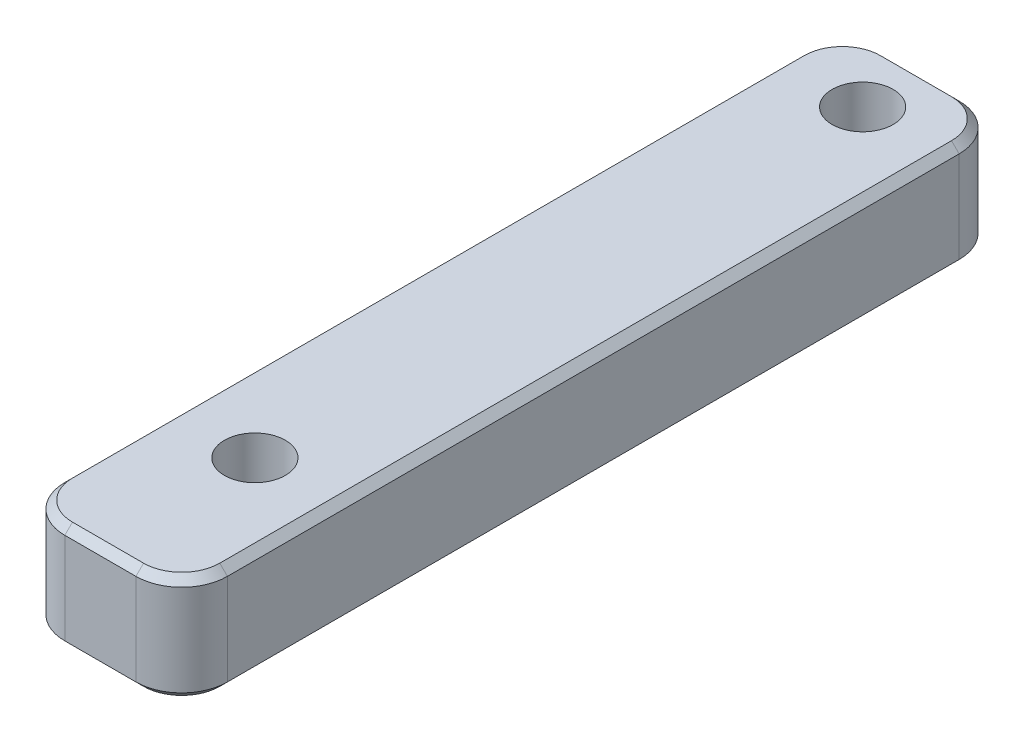
ISO-10303-21;
HEADER;
FILE_DESCRIPTION(('STEP AP214'),'2;1');
FILE_NAME('part.step','',(''),(''),'','','');
FILE_SCHEMA(('AUTOMOTIVE_DESIGN { 1 0 10303 214 1 1 1 1 }'));
ENDSEC;
DATA;
#1=APPLICATION_CONTEXT('core data for automotive mechanical design processes');
#2=APPLICATION_PROTOCOL_DEFINITION('international standard','automotive_design',2000,#1);
#3=PRODUCT_CONTEXT('',#1,'mechanical');
#4=PRODUCT('Part','Part','',(#3));
#5=PRODUCT_RELATED_PRODUCT_CATEGORY('part','',(#4));
#6=PRODUCT_DEFINITION_FORMATION('','',#4);
#7=PRODUCT_DEFINITION_CONTEXT('part definition',#1,'design');
#8=PRODUCT_DEFINITION('design','',#6,#7);
#9=PRODUCT_DEFINITION_SHAPE('','',#8);
#10=(LENGTH_UNIT() NAMED_UNIT(*) SI_UNIT(.MILLI.,.METRE.));
#11=(NAMED_UNIT(*) PLANE_ANGLE_UNIT() SI_UNIT($,.RADIAN.));
#12=(NAMED_UNIT(*) SI_UNIT($,.STERADIAN.) SOLID_ANGLE_UNIT());
#13=UNCERTAINTY_MEASURE_WITH_UNIT(LENGTH_MEASURE(1.E-05),#10,'distance_accuracy_value','');
#14=(GEOMETRIC_REPRESENTATION_CONTEXT(3) GLOBAL_UNCERTAINTY_ASSIGNED_CONTEXT((#13)) GLOBAL_UNIT_ASSIGNED_CONTEXT((#10,
#11,#12)) REPRESENTATION_CONTEXT('',''));
#15=CARTESIAN_POINT('',(0.,0.,0.));
#16=DIRECTION('',(0.,0.,1.));
#17=DIRECTION('',(1.,0.,0.));
#18=AXIS2_PLACEMENT_3D('',#15,#16,#17);
#19=CARTESIAN_POINT('',(0.,3.5,-27.));
#20=DIRECTION('',(0.,0.,1.));
#21=DIRECTION('',(1.,0.,0.));
#22=AXIS2_PLACEMENT_3D('',#19,#20,#21);
#23=PLANE('',#22);
#24=DIRECTION('',(0.,-1.,0.));
#25=VECTOR('',#24,1.);
#26=CARTESIAN_POINT('',(1.5,3.5,-27.));
#27=LINE('',#26,#25);
#28=CARTESIAN_POINT('',(1.5,0.250000000000005,-27.));
#29=VERTEX_POINT('',#28);
#30=CARTESIAN_POINT('',(1.5,3.25,-27.));
#31=VERTEX_POINT('',#30);
#32=EDGE_CURVE('E170',#29,#31,#27,.F.);
#33=ORIENTED_EDGE('',*,*,#32,.T.);
#34=DIRECTION('',(1.,0.,0.));
#35=VECTOR('',#34,1.);
#36=CARTESIAN_POINT('',(3.832575,3.25,-27.));
#37=LINE('',#36,#35);
#38=CARTESIAN_POINT('',(3.832575,3.25,-27.));
#39=VERTEX_POINT('',#38);
#40=EDGE_CURVE('E243',#31,#39,#37,.T.);
#41=ORIENTED_EDGE('',*,*,#40,.T.);
#42=DIRECTION('',(0.,-1.,0.));
#43=VECTOR('',#42,1.);
#44=CARTESIAN_POINT('',(3.832575,3.5,-27.));
#45=LINE('',#44,#43);
#46=CARTESIAN_POINT('',(3.832575,0.250000000000005,-27.));
#47=VERTEX_POINT('',#46);
#48=EDGE_CURVE('E310',#39,#47,#45,.T.);
#49=ORIENTED_EDGE('',*,*,#48,.T.);
#50=DIRECTION('',(-1.,0.,0.));
#51=VECTOR('',#50,1.);
#52=CARTESIAN_POINT('',(0.,0.250000000000005,-27.));
#53=LINE('',#52,#51);
#54=EDGE_CURVE('E241',#47,#29,#53,.T.);
#55=ORIENTED_EDGE('',*,*,#54,.T.);
#56=EDGE_LOOP('',(#33,#41,#49,#55));
#57=FACE_BOUND('',#56,.T.);
#58=ADVANCED_FACE('F35',(#57),#23,.F.);
#59=CARTESIAN_POINT('',(0.,3.5,0.));
#60=DIRECTION('',(1.,0.,0.));
#61=DIRECTION('',(0.,0.,-1.));
#62=AXIS2_PLACEMENT_3D('',#59,#60,#61);
#63=PLANE('',#62);
#64=DIRECTION('',(0.,-1.,0.));
#65=VECTOR('',#64,1.);
#66=CARTESIAN_POINT('',(0.,3.5,-1.5));
#67=LINE('',#66,#65);
#68=CARTESIAN_POINT('',(0.,0.250000000000005,-1.5));
#69=VERTEX_POINT('',#68);
#70=CARTESIAN_POINT('',(0.,3.25,-1.5));
#71=VERTEX_POINT('',#70);
#72=EDGE_CURVE('E338',#69,#71,#67,.F.);
#73=ORIENTED_EDGE('',*,*,#72,.T.);
#74=DIRECTION('',(0.,0.,-1.));
#75=VECTOR('',#74,1.);
#76=CARTESIAN_POINT('',(0.,3.25,-25.5));
#77=LINE('',#76,#75);
#78=CARTESIAN_POINT('',(0.,3.25,-25.5));
#79=VERTEX_POINT('',#78);
#80=EDGE_CURVE('E289',#71,#79,#77,.T.);
#81=ORIENTED_EDGE('',*,*,#80,.T.);
#82=DIRECTION('',(0.,-1.,0.));
#83=VECTOR('',#82,1.);
#84=CARTESIAN_POINT('',(0.,3.5,-25.5));
#85=LINE('',#84,#83);
#86=CARTESIAN_POINT('',(0.,0.250000000000005,-25.5));
#87=VERTEX_POINT('',#86);
#88=EDGE_CURVE('E304',#79,#87,#85,.T.);
#89=ORIENTED_EDGE('',*,*,#88,.T.);
#90=DIRECTION('',(0.,0.,1.));
#91=VECTOR('',#90,1.);
#92=CARTESIAN_POINT('',(0.,0.250000000000005,0.));
#93=LINE('',#92,#91);
#94=EDGE_CURVE('E284',#87,#69,#93,.T.);
#95=ORIENTED_EDGE('',*,*,#94,.T.);
#96=EDGE_LOOP('',(#73,#81,#89,#95));
#97=FACE_BOUND('',#96,.T.);
#98=ADVANCED_FACE('F358',(#97),#63,.F.);
#99=CARTESIAN_POINT('',(0.,3.5,0.));
#100=DIRECTION('',(0.,0.,-1.));
#101=DIRECTION('',(-1.,0.,0.));
#102=AXIS2_PLACEMENT_3D('',#99,#100,#101);
#103=PLANE('',#102);
#104=DIRECTION('',(0.,-1.,0.));
#105=VECTOR('',#104,1.);
#106=CARTESIAN_POINT('',(3.832575,3.5,0.));
#107=LINE('',#106,#105);
#108=CARTESIAN_POINT('',(3.832575,0.250000000000005,0.));
#109=VERTEX_POINT('',#108);
#110=CARTESIAN_POINT('',(3.832575,3.25,0.));
#111=VERTEX_POINT('',#110);
#112=EDGE_CURVE('E344',#109,#111,#107,.F.);
#113=ORIENTED_EDGE('',*,*,#112,.T.);
#114=DIRECTION('',(-1.,0.,0.));
#115=VECTOR('',#114,1.);
#116=CARTESIAN_POINT('',(1.5,3.25,0.));
#117=LINE('',#116,#115);
#118=CARTESIAN_POINT('',(1.5,3.25,0.));
#119=VERTEX_POINT('',#118);
#120=EDGE_CURVE('E331',#111,#119,#117,.T.);
#121=ORIENTED_EDGE('',*,*,#120,.T.);
#122=DIRECTION('',(0.,-1.,0.));
#123=VECTOR('',#122,1.);
#124=CARTESIAN_POINT('',(1.5,3.5,0.));
#125=LINE('',#124,#123);
#126=CARTESIAN_POINT('',(1.5,0.250000000000005,0.));
#127=VERTEX_POINT('',#126);
#128=EDGE_CURVE('E336',#119,#127,#125,.T.);
#129=ORIENTED_EDGE('',*,*,#128,.T.);
#130=DIRECTION('',(1.,0.,0.));
#131=VECTOR('',#130,1.);
#132=CARTESIAN_POINT('',(0.,0.250000000000005,0.));
#133=LINE('',#132,#131);
#134=EDGE_CURVE('E268',#127,#109,#133,.T.);
#135=ORIENTED_EDGE('',*,*,#134,.T.);
#136=EDGE_LOOP('',(#113,#121,#129,#135));
#137=FACE_BOUND('',#136,.T.);
#138=ADVANCED_FACE('F341',(#137),#103,.F.);
#139=CARTESIAN_POINT('',(5.332575,3.5,0.));
#140=DIRECTION('',(-1.,0.,0.));
#141=DIRECTION('',(0.,0.,1.));
#142=AXIS2_PLACEMENT_3D('',#139,#140,#141);
#143=PLANE('',#142);
#144=DIRECTION('',(0.,-1.,0.));
#145=VECTOR('',#144,1.);
#146=CARTESIAN_POINT('',(5.332575,3.5,-25.5));
#147=LINE('',#146,#145);
#148=CARTESIAN_POINT('',(5.332575,0.250000000000005,-25.5));
#149=VERTEX_POINT('',#148);
#150=CARTESIAN_POINT('',(5.332575,3.25,-25.5));
#151=VERTEX_POINT('',#150);
#152=EDGE_CURVE('E348',#149,#151,#147,.F.);
#153=ORIENTED_EDGE('',*,*,#152,.T.);
#154=DIRECTION('',(0.,0.,1.));
#155=VECTOR('',#154,1.);
#156=CARTESIAN_POINT('',(5.332575,3.25,-1.5));
#157=LINE('',#156,#155);
#158=CARTESIAN_POINT('',(5.332575,3.25,-1.5));
#159=VERTEX_POINT('',#158);
#160=EDGE_CURVE('E227',#151,#159,#157,.T.);
#161=ORIENTED_EDGE('',*,*,#160,.T.);
#162=DIRECTION('',(0.,-1.,0.));
#163=VECTOR('',#162,1.);
#164=CARTESIAN_POINT('',(5.332575,3.5,-1.5));
#165=LINE('',#164,#163);
#166=CARTESIAN_POINT('',(5.332575,0.250000000000005,-1.5));
#167=VERTEX_POINT('',#166);
#168=EDGE_CURVE('E345',#159,#167,#165,.T.);
#169=ORIENTED_EDGE('',*,*,#168,.T.);
#170=DIRECTION('',(0.,0.,-1.));
#171=VECTOR('',#170,1.);
#172=CARTESIAN_POINT('',(5.332575,0.250000000000005,0.));
#173=LINE('',#172,#171);
#174=EDGE_CURVE('E233',#167,#149,#173,.T.);
#175=ORIENTED_EDGE('',*,*,#174,.T.);
#176=EDGE_LOOP('',(#153,#161,#169,#175));
#177=FACE_BOUND('',#176,.T.);
#178=ADVANCED_FACE('F414',(#177),#143,.F.);
#179=CARTESIAN_POINT('',(0.,3.5,0.));
#180=DIRECTION('',(0.,1.,0.));
#181=DIRECTION('',(0.,0.,1.));
#182=AXIS2_PLACEMENT_3D('',#179,#180,#181);
#183=PLANE('',#182);
#184=DIRECTION('',(1.,0.,0.));
#185=VECTOR('',#184,1.);
#186=CARTESIAN_POINT('',(3.832575,3.5,-0.25));
#187=LINE('',#186,#185);
#188=CARTESIAN_POINT('',(1.5,3.5,-0.25));
#189=VERTEX_POINT('',#188);
#190=CARTESIAN_POINT('',(3.832575,3.5,-0.25));
#191=VERTEX_POINT('',#190);
#192=EDGE_CURVE('E322',#189,#191,#187,.T.);
#193=ORIENTED_EDGE('',*,*,#192,.T.);
#194=CARTESIAN_POINT('',(3.832575,3.5,-1.5));
#195=DIRECTION('',(0.,1.,0.));
#196=DIRECTION('',(0.,0.,1.));
#197=AXIS2_PLACEMENT_3D('',#194,#195,#196);
#198=CIRCLE('',#197,1.25);
#199=CARTESIAN_POINT('',(5.082575,3.5,-1.5));
#200=VERTEX_POINT('',#199);
#201=EDGE_CURVE('E324',#191,#200,#198,.T.);
#202=ORIENTED_EDGE('',*,*,#201,.T.);
#203=DIRECTION('',(0.,0.,-1.));
#204=VECTOR('',#203,1.);
#205=CARTESIAN_POINT('',(5.082575,3.5,-25.5));
#206=LINE('',#205,#204);
#207=CARTESIAN_POINT('',(5.082575,3.5,-25.5));
#208=VERTEX_POINT('',#207);
#209=EDGE_CURVE('E155',#200,#208,#206,.T.);
#210=ORIENTED_EDGE('',*,*,#209,.T.);
#211=CARTESIAN_POINT('',(3.832575,3.5,-25.5));
#212=DIRECTION('',(0.,1.,0.));
#213=DIRECTION('',(0.,0.,1.));
#214=AXIS2_PLACEMENT_3D('',#211,#212,#213);
#215=CIRCLE('',#214,1.25);
#216=CARTESIAN_POINT('',(3.832575,3.5,-26.75));
#217=VERTEX_POINT('',#216);
#218=EDGE_CURVE('E147',#208,#217,#215,.T.);
#219=ORIENTED_EDGE('',*,*,#218,.T.);
#220=DIRECTION('',(-1.,0.,0.));
#221=VECTOR('',#220,1.);
#222=CARTESIAN_POINT('',(1.5,3.5,-26.75));
#223=LINE('',#222,#221);
#224=CARTESIAN_POINT('',(1.5,3.5,-26.75));
#225=VERTEX_POINT('',#224);
#226=EDGE_CURVE('E151',#217,#225,#223,.T.);
#227=ORIENTED_EDGE('',*,*,#226,.T.);
#228=CARTESIAN_POINT('',(1.5,3.5,-25.5));
#229=DIRECTION('',(0.,1.,0.));
#230=DIRECTION('',(0.,0.,1.));
#231=AXIS2_PLACEMENT_3D('',#228,#229,#230);
#232=CIRCLE('',#231,1.25);
#233=CARTESIAN_POINT('',(0.249999999999999,3.5,-25.5));
#234=VERTEX_POINT('',#233);
#235=EDGE_CURVE('E313',#225,#234,#232,.T.);
#236=ORIENTED_EDGE('',*,*,#235,.T.);
#237=DIRECTION('',(0.,0.,1.));
#238=VECTOR('',#237,1.);
#239=CARTESIAN_POINT('',(0.25,3.5,-1.5));
#240=LINE('',#239,#238);
#241=CARTESIAN_POINT('',(0.25,3.5,-1.5));
#242=VERTEX_POINT('',#241);
#243=EDGE_CURVE('E315',#234,#242,#240,.T.);
#244=ORIENTED_EDGE('',*,*,#243,.T.);
#245=CARTESIAN_POINT('',(1.5,3.5,-1.5));
#246=DIRECTION('',(0.,1.,0.));
#247=DIRECTION('',(0.,0.,1.));
#248=AXIS2_PLACEMENT_3D('',#245,#246,#247);
#249=CIRCLE('',#248,1.25);
#250=EDGE_CURVE('E317',#242,#189,#249,.T.);
#251=ORIENTED_EDGE('',*,*,#250,.T.);
#252=EDGE_LOOP('',(#193,#202,#210,#219,#227,#236,#244,#251));
#253=FACE_BOUND('',#252,.T.);
#254=CARTESIAN_POINT('',(2.6662875,3.5,-5.06736000000001));
#255=DIRECTION('',(0.,1.,0.));
#256=DIRECTION('',(0.,0.,1.));
#257=AXIS2_PLACEMENT_3D('',#254,#255,#256);
#258=CIRCLE('',#257,1.);
#259=CARTESIAN_POINT('',(2.6662875,3.5,-4.06736000000001));
#260=VERTEX_POINT('',#259);
#261=EDGE_CURVE('E188',#260,#260,#258,.T.);
#262=ORIENTED_EDGE('',*,*,#261,.F.);
#263=EDGE_LOOP('',(#262));
#264=FACE_BOUND('',#263,.T.);
#265=CARTESIAN_POINT('',(2.6662875,3.5,-25.));
#266=DIRECTION('',(0.,1.,0.));
#267=DIRECTION('',(0.,0.,1.));
#268=AXIS2_PLACEMENT_3D('',#265,#266,#267);
#269=CIRCLE('',#268,1.);
#270=CARTESIAN_POINT('',(2.6662875,3.5,-24.));
#271=VERTEX_POINT('',#270);
#272=EDGE_CURVE('E607',#271,#271,#269,.T.);
#273=ORIENTED_EDGE('',*,*,#272,.F.);
#274=EDGE_LOOP('',(#273));
#275=FACE_BOUND('',#274,.T.);
#276=ADVANCED_FACE('F149',(#253,#264,#275),#183,.T.);
#277=CARTESIAN_POINT('',(0.,0.,0.));
#278=DIRECTION('',(0.,1.,0.));
#279=DIRECTION('',(0.,0.,1.));
#280=AXIS2_PLACEMENT_3D('',#277,#278,#279);
#281=PLANE('',#280);
#282=DIRECTION('',(-1.,0.,0.));
#283=VECTOR('',#282,1.);
#284=CARTESIAN_POINT('',(0.,0.,-0.25));
#285=LINE('',#284,#283);
#286=CARTESIAN_POINT('',(3.832575,0.,-0.25));
#287=VERTEX_POINT('',#286);
#288=CARTESIAN_POINT('',(1.5,0.,-0.25));
#289=VERTEX_POINT('',#288);
#290=EDGE_CURVE('E44',#287,#289,#285,.T.);
#291=ORIENTED_EDGE('',*,*,#290,.T.);
#292=CARTESIAN_POINT('',(1.5,0.,-1.5));
#293=DIRECTION('',(0.,1.,0.));
#294=DIRECTION('',(0.,0.,1.));
#295=AXIS2_PLACEMENT_3D('',#292,#293,#294);
#296=CIRCLE('',#295,1.25);
#297=CARTESIAN_POINT('',(0.25,0.,-1.5));
#298=VERTEX_POINT('',#297);
#299=EDGE_CURVE('E11',#289,#298,#296,.F.);
#300=ORIENTED_EDGE('',*,*,#299,.T.);
#301=DIRECTION('',(0.,0.,-1.));
#302=VECTOR('',#301,1.);
#303=CARTESIAN_POINT('',(0.25,0.,0.));
#304=LINE('',#303,#302);
#305=CARTESIAN_POINT('',(0.249999999999999,0.,-25.5));
#306=VERTEX_POINT('',#305);
#307=EDGE_CURVE('E251',#298,#306,#304,.T.);
#308=ORIENTED_EDGE('',*,*,#307,.T.);
#309=CARTESIAN_POINT('',(1.5,0.,-25.5));
#310=DIRECTION('',(0.,1.,0.));
#311=DIRECTION('',(0.,0.,1.));
#312=AXIS2_PLACEMENT_3D('',#309,#310,#311);
#313=CIRCLE('',#312,1.25);
#314=CARTESIAN_POINT('',(1.5,0.,-26.75));
#315=VERTEX_POINT('',#314);
#316=EDGE_CURVE('E249',#306,#315,#313,.F.);
#317=ORIENTED_EDGE('',*,*,#316,.T.);
#318=DIRECTION('',(1.,0.,0.));
#319=VECTOR('',#318,1.);
#320=CARTESIAN_POINT('',(0.,0.,-26.75));
#321=LINE('',#320,#319);
#322=CARTESIAN_POINT('',(3.832575,0.,-26.75));
#323=VERTEX_POINT('',#322);
#324=EDGE_CURVE('E247',#315,#323,#321,.T.);
#325=ORIENTED_EDGE('',*,*,#324,.T.);
#326=CARTESIAN_POINT('',(3.832575,0.,-25.5));
#327=DIRECTION('',(0.,1.,0.));
#328=DIRECTION('',(0.,0.,1.));
#329=AXIS2_PLACEMENT_3D('',#326,#327,#328);
#330=CIRCLE('',#329,1.25);
#331=CARTESIAN_POINT('',(5.082575,0.,-25.5));
#332=VERTEX_POINT('',#331);
#333=EDGE_CURVE('E245',#323,#332,#330,.F.);
#334=ORIENTED_EDGE('',*,*,#333,.T.);
#335=DIRECTION('',(0.,0.,1.));
#336=VECTOR('',#335,1.);
#337=CARTESIAN_POINT('',(5.082575,0.,0.));
#338=LINE('',#337,#336);
#339=CARTESIAN_POINT('',(5.082575,0.,-1.5));
#340=VERTEX_POINT('',#339);
#341=EDGE_CURVE('E253',#332,#340,#338,.T.);
#342=ORIENTED_EDGE('',*,*,#341,.T.);
#343=CARTESIAN_POINT('',(3.832575,0.,-1.5));
#344=DIRECTION('',(0.,1.,0.));
#345=DIRECTION('',(0.,0.,1.));
#346=AXIS2_PLACEMENT_3D('',#343,#344,#345);
#347=CIRCLE('',#346,1.25);
#348=EDGE_CURVE('E55',#340,#287,#347,.F.);
#349=ORIENTED_EDGE('',*,*,#348,.T.);
#350=EDGE_LOOP('',(#291,#300,#308,#317,#325,#334,#342,#349));
#351=FACE_BOUND('',#350,.T.);
#352=CARTESIAN_POINT('',(2.6662875,0.,-5.06736000000001));
#353=DIRECTION('',(0.,1.,0.));
#354=DIRECTION('',(0.,0.,1.));
#355=AXIS2_PLACEMENT_3D('',#352,#353,#354);
#356=CIRCLE('',#355,1.);
#357=CARTESIAN_POINT('',(2.6662875,0.,-4.06736000000001));
#358=VERTEX_POINT('',#357);
#359=EDGE_CURVE('E611',#358,#358,#356,.T.);
#360=ORIENTED_EDGE('',*,*,#359,.T.);
#361=EDGE_LOOP('',(#360));
#362=FACE_BOUND('',#361,.T.);
#363=CARTESIAN_POINT('',(2.6662875,0.,-25.));
#364=DIRECTION('',(0.,1.,0.));
#365=DIRECTION('',(0.,0.,1.));
#366=AXIS2_PLACEMENT_3D('',#363,#364,#365);
#367=CIRCLE('',#366,1.);
#368=CARTESIAN_POINT('',(2.6662875,0.,-24.));
#369=VERTEX_POINT('',#368);
#370=EDGE_CURVE('E605',#369,#369,#367,.T.);
#371=ORIENTED_EDGE('',*,*,#370,.T.);
#372=EDGE_LOOP('',(#371));
#373=FACE_BOUND('',#372,.T.);
#374=ADVANCED_FACE('F256',(#351,#362,#373),#281,.F.);
#375=CARTESIAN_POINT('',(3.832575,3.5,-1.5));
#376=DIRECTION('',(0.,-1.,0.));
#377=DIRECTION('',(0.,0.,-1.));
#378=AXIS2_PLACEMENT_3D('',#375,#376,#377);
#379=CYLINDRICAL_SURFACE('',#378,1.5);
#380=ORIENTED_EDGE('',*,*,#168,.F.);
#381=CARTESIAN_POINT('',(3.832575,3.25,-1.5));
#382=DIRECTION('',(0.,1.,0.));
#383=DIRECTION('',(0.,0.,1.));
#384=AXIS2_PLACEMENT_3D('',#381,#382,#383);
#385=CIRCLE('',#384,1.5);
#386=EDGE_CURVE('E327',#159,#111,#385,.F.);
#387=ORIENTED_EDGE('',*,*,#386,.T.);
#388=ORIENTED_EDGE('',*,*,#112,.F.);
#389=CARTESIAN_POINT('',(3.832575,0.250000000000005,-1.5));
#390=DIRECTION('',(0.,1.,0.));
#391=DIRECTION('',(0.,0.,1.));
#392=AXIS2_PLACEMENT_3D('',#389,#390,#391);
#393=CIRCLE('',#392,1.5);
#394=EDGE_CURVE('E263',#109,#167,#393,.T.);
#395=ORIENTED_EDGE('',*,*,#394,.T.);
#396=EDGE_LOOP('',(#380,#387,#388,#395));
#397=FACE_BOUND('',#396,.T.);
#398=ADVANCED_FACE('F388',(#397),#379,.T.);
#399=CARTESIAN_POINT('',(1.5,3.5,-1.5));
#400=DIRECTION('',(0.,-1.,0.));
#401=DIRECTION('',(0.,0.,-1.));
#402=AXIS2_PLACEMENT_3D('',#399,#400,#401);
#403=CYLINDRICAL_SURFACE('',#402,1.5);
#404=ORIENTED_EDGE('',*,*,#128,.F.);
#405=CARTESIAN_POINT('',(1.5,3.25,-1.5));
#406=DIRECTION('',(0.,1.,0.));
#407=DIRECTION('',(0.,0.,1.));
#408=AXIS2_PLACEMENT_3D('',#405,#406,#407);
#409=CIRCLE('',#408,1.5);
#410=EDGE_CURVE('E290',#119,#71,#409,.F.);
#411=ORIENTED_EDGE('',*,*,#410,.T.);
#412=ORIENTED_EDGE('',*,*,#72,.F.);
#413=CARTESIAN_POINT('',(1.5,0.250000000000005,-1.5));
#414=DIRECTION('',(0.,1.,0.));
#415=DIRECTION('',(0.,0.,1.));
#416=AXIS2_PLACEMENT_3D('',#413,#414,#415);
#417=CIRCLE('',#416,1.5);
#418=EDGE_CURVE('E294',#69,#127,#417,.T.);
#419=ORIENTED_EDGE('',*,*,#418,.T.);
#420=EDGE_LOOP('',(#404,#411,#412,#419));
#421=FACE_BOUND('',#420,.T.);
#422=ADVANCED_FACE('F335',(#421),#403,.T.);
#423=CARTESIAN_POINT('',(1.5,3.5,-25.5));
#424=DIRECTION('',(0.,-1.,0.));
#425=DIRECTION('',(0.,0.,-1.));
#426=AXIS2_PLACEMENT_3D('',#423,#424,#425);
#427=CYLINDRICAL_SURFACE('',#426,1.5);
#428=ORIENTED_EDGE('',*,*,#88,.F.);
#429=CARTESIAN_POINT('',(1.5,3.25,-25.5));
#430=DIRECTION('',(0.,1.,0.));
#431=DIRECTION('',(0.,0.,1.));
#432=AXIS2_PLACEMENT_3D('',#429,#430,#431);
#433=CIRCLE('',#432,1.5);
#434=EDGE_CURVE('E236',#79,#31,#433,.F.);
#435=ORIENTED_EDGE('',*,*,#434,.T.);
#436=ORIENTED_EDGE('',*,*,#32,.F.);
#437=CARTESIAN_POINT('',(1.5,0.250000000000005,-25.5));
#438=DIRECTION('',(0.,1.,0.));
#439=DIRECTION('',(0.,0.,1.));
#440=AXIS2_PLACEMENT_3D('',#437,#438,#439);
#441=CIRCLE('',#440,1.5);
#442=EDGE_CURVE('E292',#29,#87,#441,.T.);
#443=ORIENTED_EDGE('',*,*,#442,.T.);
#444=EDGE_LOOP('',(#428,#435,#436,#443));
#445=FACE_BOUND('',#444,.T.);
#446=ADVANCED_FACE('F303',(#445),#427,.T.);
#447=CARTESIAN_POINT('',(3.832575,3.5,-25.5));
#448=DIRECTION('',(0.,-1.,0.));
#449=DIRECTION('',(0.,0.,-1.));
#450=AXIS2_PLACEMENT_3D('',#447,#448,#449);
#451=CYLINDRICAL_SURFACE('',#450,1.5);
#452=ORIENTED_EDGE('',*,*,#48,.F.);
#453=CARTESIAN_POINT('',(3.832575,3.25,-25.5));
#454=DIRECTION('',(0.,1.,0.));
#455=DIRECTION('',(0.,0.,1.));
#456=AXIS2_PLACEMENT_3D('',#453,#454,#455);
#457=CIRCLE('',#456,1.5);
#458=EDGE_CURVE('E173',#39,#151,#457,.F.);
#459=ORIENTED_EDGE('',*,*,#458,.T.);
#460=ORIENTED_EDGE('',*,*,#152,.F.);
#461=CARTESIAN_POINT('',(3.832575,0.250000000000005,-25.5));
#462=DIRECTION('',(0.,1.,0.));
#463=DIRECTION('',(0.,0.,1.));
#464=AXIS2_PLACEMENT_3D('',#461,#462,#463);
#465=CIRCLE('',#464,1.5);
#466=EDGE_CURVE('E232',#149,#47,#465,.T.);
#467=ORIENTED_EDGE('',*,*,#466,.T.);
#468=EDGE_LOOP('',(#452,#459,#460,#467));
#469=FACE_BOUND('',#468,.T.);
#470=ADVANCED_FACE('F395',(#469),#451,.T.);
#471=CARTESIAN_POINT('',(2.6662875,0.,-25.));
#472=DIRECTION('',(0.,1.,0.));
#473=DIRECTION('',(0.,0.,1.));
#474=AXIS2_PLACEMENT_3D('',#471,#472,#473);
#475=CYLINDRICAL_SURFACE('',#474,1.);
#476=ORIENTED_EDGE('',*,*,#370,.F.);
#477=EDGE_LOOP('',(#476));
#478=FACE_BOUND('',#477,.T.);
#479=ORIENTED_EDGE('',*,*,#272,.T.);
#480=EDGE_LOOP('',(#479));
#481=FACE_BOUND('',#480,.T.);
#482=ADVANCED_FACE('F397',(#478,#481),#475,.F.);
#483=CARTESIAN_POINT('',(2.6662875,0.,-5.06736000000001));
#484=DIRECTION('',(0.,1.,0.));
#485=DIRECTION('',(0.,0.,1.));
#486=AXIS2_PLACEMENT_3D('',#483,#484,#485);
#487=CYLINDRICAL_SURFACE('',#486,1.);
#488=ORIENTED_EDGE('',*,*,#359,.F.);
#489=EDGE_LOOP('',(#488));
#490=FACE_BOUND('',#489,.T.);
#491=ORIENTED_EDGE('',*,*,#261,.T.);
#492=EDGE_LOOP('',(#491));
#493=FACE_BOUND('',#492,.T.);
#494=ADVANCED_FACE('F401',(#490,#493),#487,.F.);
#495=CARTESIAN_POINT('',(1.5,3.5,-25.5));
#496=DIRECTION('',(0.,-1.,0.));
#497=DIRECTION('',(0.,0.,-1.));
#498=AXIS2_PLACEMENT_3D('',#495,#496,#497);
#499=CONICAL_SURFACE('',#498,1.25,0.785398163397446);
#500=DIRECTION('',(0.,0.707106781186547,0.707106781186547));
#501=VECTOR('',#500,1.);
#502=CARTESIAN_POINT('',(1.5,3.25,-27.));
#503=LINE('',#502,#501);
#504=EDGE_CURVE('E169',#31,#225,#503,.T.);
#505=ORIENTED_EDGE('',*,*,#504,.F.);
#506=ORIENTED_EDGE('',*,*,#434,.F.);
#507=DIRECTION('',(-0.707106781186546,-0.707106781186549,0.));
#508=VECTOR('',#507,1.);
#509=CARTESIAN_POINT('',(0.249999999999999,3.5,-25.5));
#510=LINE('',#509,#508);
#511=EDGE_CURVE('E185',#234,#79,#510,.T.);
#512=ORIENTED_EDGE('',*,*,#511,.F.);
#513=ORIENTED_EDGE('',*,*,#235,.F.);
#514=EDGE_LOOP('',(#505,#506,#512,#513));
#515=FACE_BOUND('',#514,.T.);
#516=ADVANCED_FACE('F312',(#515),#499,.T.);
#517=CARTESIAN_POINT('',(0.25,3.5,0.));
#518=DIRECTION('',(-0.707106781186547,0.707106781186547,0.));
#519=DIRECTION('',(0.,0.,-1.));
#520=AXIS2_PLACEMENT_3D('',#517,#518,#519);
#521=PLANE('',#520);
#522=ORIENTED_EDGE('',*,*,#511,.T.);
#523=ORIENTED_EDGE('',*,*,#80,.F.);
#524=DIRECTION('',(-0.707106781186547,-0.707106781186547,0.));
#525=VECTOR('',#524,1.);
#526=CARTESIAN_POINT('',(0.25,3.5,-1.5));
#527=LINE('',#526,#525);
#528=EDGE_CURVE('E174',#242,#71,#527,.T.);
#529=ORIENTED_EDGE('',*,*,#528,.F.);
#530=ORIENTED_EDGE('',*,*,#243,.F.);
#531=EDGE_LOOP('',(#522,#523,#529,#530));
#532=FACE_BOUND('',#531,.T.);
#533=ADVANCED_FACE('F362',(#532),#521,.T.);
#534=CARTESIAN_POINT('',(0.,3.5,-26.75));
#535=DIRECTION('',(0.,0.707106781186547,-0.707106781186547));
#536=DIRECTION('',(1.,0.,0.));
#537=AXIS2_PLACEMENT_3D('',#534,#535,#536);
#538=PLANE('',#537);
#539=ORIENTED_EDGE('',*,*,#504,.T.);
#540=ORIENTED_EDGE('',*,*,#226,.F.);
#541=DIRECTION('',(0.,0.707106781186547,0.707106781186547));
#542=VECTOR('',#541,1.);
#543=CARTESIAN_POINT('',(3.832575,3.25,-27.));
#544=LINE('',#543,#542);
#545=EDGE_CURVE('E166',#39,#217,#544,.T.);
#546=ORIENTED_EDGE('',*,*,#545,.F.);
#547=ORIENTED_EDGE('',*,*,#40,.F.);
#548=EDGE_LOOP('',(#539,#540,#546,#547));
#549=FACE_BOUND('',#548,.T.);
#550=ADVANCED_FACE('F164',(#549),#538,.T.);
#551=CARTESIAN_POINT('',(1.5,3.5,-1.5));
#552=DIRECTION('',(0.,-1.,0.));
#553=DIRECTION('',(0.,0.,-1.));
#554=AXIS2_PLACEMENT_3D('',#551,#552,#553);
#555=CONICAL_SURFACE('',#554,1.25,0.785398163397448);
#556=ORIENTED_EDGE('',*,*,#528,.T.);
#557=ORIENTED_EDGE('',*,*,#410,.F.);
#558=DIRECTION('',(0.,-0.707106781186547,0.707106781186547));
#559=VECTOR('',#558,1.);
#560=CARTESIAN_POINT('',(1.5,3.5,-0.25));
#561=LINE('',#560,#559);
#562=EDGE_CURVE('E175',#189,#119,#561,.T.);
#563=ORIENTED_EDGE('',*,*,#562,.F.);
#564=ORIENTED_EDGE('',*,*,#250,.F.);
#565=EDGE_LOOP('',(#556,#557,#563,#564));
#566=FACE_BOUND('',#565,.T.);
#567=ADVANCED_FACE('F365',(#566),#555,.T.);
#568=CARTESIAN_POINT('',(3.832575,3.5,-25.5));
#569=DIRECTION('',(0.,-1.,0.));
#570=DIRECTION('',(0.,0.,-1.));
#571=AXIS2_PLACEMENT_3D('',#568,#569,#570);
#572=CONICAL_SURFACE('',#571,1.25,0.785398163397448);
#573=ORIENTED_EDGE('',*,*,#545,.T.);
#574=ORIENTED_EDGE('',*,*,#218,.F.);
#575=DIRECTION('',(-0.707106781186546,0.707106781186549,0.));
#576=VECTOR('',#575,1.);
#577=CARTESIAN_POINT('',(5.332575,3.25,-25.5));
#578=LINE('',#577,#576);
#579=EDGE_CURVE('E180',#151,#208,#578,.T.);
#580=ORIENTED_EDGE('',*,*,#579,.F.);
#581=ORIENTED_EDGE('',*,*,#458,.F.);
#582=EDGE_LOOP('',(#573,#574,#580,#581));
#583=FACE_BOUND('',#582,.T.);
#584=ADVANCED_FACE('F172',(#583),#572,.T.);
#585=CARTESIAN_POINT('',(0.,3.5,-0.25));
#586=DIRECTION('',(0.,0.707106781186547,0.707106781186547));
#587=DIRECTION('',(-1.,0.,0.));
#588=AXIS2_PLACEMENT_3D('',#585,#586,#587);
#589=PLANE('',#588);
#590=ORIENTED_EDGE('',*,*,#562,.T.);
#591=ORIENTED_EDGE('',*,*,#120,.F.);
#592=DIRECTION('',(0.,-0.707106781186547,0.707106781186547));
#593=VECTOR('',#592,1.);
#594=CARTESIAN_POINT('',(3.832575,3.5,-0.25));
#595=LINE('',#594,#593);
#596=EDGE_CURVE('E216',#191,#111,#595,.T.);
#597=ORIENTED_EDGE('',*,*,#596,.F.);
#598=ORIENTED_EDGE('',*,*,#192,.F.);
#599=EDGE_LOOP('',(#590,#591,#597,#598));
#600=FACE_BOUND('',#599,.T.);
#601=ADVANCED_FACE('F370',(#600),#589,.T.);
#602=CARTESIAN_POINT('',(5.082575,3.5,0.));
#603=DIRECTION('',(0.707106781186547,0.707106781186547,0.));
#604=DIRECTION('',(0.,0.,1.));
#605=AXIS2_PLACEMENT_3D('',#602,#603,#604);
#606=PLANE('',#605);
#607=ORIENTED_EDGE('',*,*,#579,.T.);
#608=ORIENTED_EDGE('',*,*,#209,.F.);
#609=DIRECTION('',(-0.707106781186547,0.707106781186547,0.));
#610=VECTOR('',#609,1.);
#611=CARTESIAN_POINT('',(5.332575,3.25,-1.5));
#612=LINE('',#611,#610);
#613=EDGE_CURVE('E211',#159,#200,#612,.T.);
#614=ORIENTED_EDGE('',*,*,#613,.F.);
#615=ORIENTED_EDGE('',*,*,#160,.F.);
#616=EDGE_LOOP('',(#607,#608,#614,#615));
#617=FACE_BOUND('',#616,.T.);
#618=ADVANCED_FACE('F226',(#617),#606,.T.);
#619=CARTESIAN_POINT('',(3.832575,3.5,-1.5));
#620=DIRECTION('',(0.,-1.,0.));
#621=DIRECTION('',(0.,0.,-1.));
#622=AXIS2_PLACEMENT_3D('',#619,#620,#621);
#623=CONICAL_SURFACE('',#622,1.25,0.785398163397448);
#624=ORIENTED_EDGE('',*,*,#596,.T.);
#625=ORIENTED_EDGE('',*,*,#386,.F.);
#626=ORIENTED_EDGE('',*,*,#613,.T.);
#627=ORIENTED_EDGE('',*,*,#201,.F.);
#628=EDGE_LOOP('',(#624,#625,#626,#627));
#629=FACE_BOUND('',#628,.T.);
#630=ADVANCED_FACE('F371',(#629),#623,.T.);
#631=CARTESIAN_POINT('',(3.832575,0.,-25.5));
#632=DIRECTION('',(0.,1.,0.));
#633=DIRECTION('',(0.,0.,1.));
#634=AXIS2_PLACEMENT_3D('',#631,#632,#633);
#635=CONICAL_SURFACE('',#634,1.25,0.785398163397439);
#636=DIRECTION('',(0.,-0.707106781186554,0.707106781186541));
#637=VECTOR('',#636,1.);
#638=CARTESIAN_POINT('',(3.832575,0.250000000000005,-27.));
#639=LINE('',#638,#637);
#640=EDGE_CURVE('E204',#47,#323,#639,.T.);
#641=ORIENTED_EDGE('',*,*,#640,.F.);
#642=ORIENTED_EDGE('',*,*,#466,.F.);
#643=DIRECTION('',(0.707106781186541,0.707106781186554,0.));
#644=VECTOR('',#643,1.);
#645=CARTESIAN_POINT('',(5.082575,0.,-25.5));
#646=LINE('',#645,#644);
#647=EDGE_CURVE('E39',#332,#149,#646,.T.);
#648=ORIENTED_EDGE('',*,*,#647,.F.);
#649=ORIENTED_EDGE('',*,*,#333,.F.);
#650=EDGE_LOOP('',(#641,#642,#648,#649));
#651=FACE_BOUND('',#650,.T.);
#652=ADVANCED_FACE('F37',(#651),#635,.T.);
#653=CARTESIAN_POINT('',(5.332575,0.250000000000005,0.));
#654=DIRECTION('',(-0.707106781186554,0.707106781186541,0.));
#655=DIRECTION('',(0.,0.,-1.));
#656=AXIS2_PLACEMENT_3D('',#653,#654,#655);
#657=PLANE('',#656);
#658=ORIENTED_EDGE('',*,*,#647,.T.);
#659=ORIENTED_EDGE('',*,*,#174,.F.);
#660=DIRECTION('',(0.707106781186541,0.707106781186554,0.));
#661=VECTOR('',#660,1.);
#662=CARTESIAN_POINT('',(5.082575,0.,-1.5));
#663=LINE('',#662,#661);
#664=EDGE_CURVE('E202',#340,#167,#663,.T.);
#665=ORIENTED_EDGE('',*,*,#664,.F.);
#666=ORIENTED_EDGE('',*,*,#341,.F.);
#667=EDGE_LOOP('',(#658,#659,#665,#666));
#668=FACE_BOUND('',#667,.T.);
#669=ADVANCED_FACE('F259',(#668),#657,.F.);
#670=CARTESIAN_POINT('',(0.,0.250000000000005,-27.));
#671=DIRECTION('',(0.,0.707106781186541,0.707106781186554));
#672=DIRECTION('',(-1.,0.,0.));
#673=AXIS2_PLACEMENT_3D('',#670,#671,#672);
#674=PLANE('',#673);
#675=ORIENTED_EDGE('',*,*,#640,.T.);
#676=ORIENTED_EDGE('',*,*,#324,.F.);
#677=DIRECTION('',(0.,-0.707106781186554,0.707106781186541));
#678=VECTOR('',#677,1.);
#679=CARTESIAN_POINT('',(1.5,0.250000000000005,-27.));
#680=LINE('',#679,#678);
#681=EDGE_CURVE('E199',#29,#315,#680,.T.);
#682=ORIENTED_EDGE('',*,*,#681,.F.);
#683=ORIENTED_EDGE('',*,*,#54,.F.);
#684=EDGE_LOOP('',(#675,#676,#682,#683));
#685=FACE_BOUND('',#684,.T.);
#686=ADVANCED_FACE('F357',(#685),#674,.F.);
#687=CARTESIAN_POINT('',(3.832575,0.,-1.5));
#688=DIRECTION('',(0.,1.,0.));
#689=DIRECTION('',(0.,0.,1.));
#690=AXIS2_PLACEMENT_3D('',#687,#688,#689);
#691=CONICAL_SURFACE('',#690,1.25,0.785398163397439);
#692=ORIENTED_EDGE('',*,*,#664,.T.);
#693=ORIENTED_EDGE('',*,*,#394,.F.);
#694=DIRECTION('',(0.,0.707106781186554,0.707106781186541));
#695=VECTOR('',#694,1.);
#696=CARTESIAN_POINT('',(3.832575,0.,-0.25));
#697=LINE('',#696,#695);
#698=EDGE_CURVE('E196',#287,#109,#697,.T.);
#699=ORIENTED_EDGE('',*,*,#698,.F.);
#700=ORIENTED_EDGE('',*,*,#348,.F.);
#701=EDGE_LOOP('',(#692,#693,#699,#700));
#702=FACE_BOUND('',#701,.T.);
#703=ADVANCED_FACE('F262',(#702),#691,.T.);
#704=CARTESIAN_POINT('',(1.5,0.,-25.5));
#705=DIRECTION('',(0.,1.,0.));
#706=DIRECTION('',(0.,0.,1.));
#707=AXIS2_PLACEMENT_3D('',#704,#705,#706);
#708=CONICAL_SURFACE('',#707,1.25,0.785398163397436);
#709=ORIENTED_EDGE('',*,*,#681,.T.);
#710=ORIENTED_EDGE('',*,*,#316,.F.);
#711=DIRECTION('',(0.707106781186539,-0.707106781186556,0.));
#712=VECTOR('',#711,1.);
#713=CARTESIAN_POINT('',(0.,0.250000000000005,-25.5));
#714=LINE('',#713,#712);
#715=EDGE_CURVE('E193',#87,#306,#714,.T.);
#716=ORIENTED_EDGE('',*,*,#715,.F.);
#717=ORIENTED_EDGE('',*,*,#442,.F.);
#718=EDGE_LOOP('',(#709,#710,#716,#717));
#719=FACE_BOUND('',#718,.T.);
#720=ADVANCED_FACE('F279',(#719),#708,.T.);
#721=CARTESIAN_POINT('',(0.,0.250000000000005,0.));
#722=DIRECTION('',(0.,0.707106781186541,-0.707106781186554));
#723=DIRECTION('',(1.,0.,0.));
#724=AXIS2_PLACEMENT_3D('',#721,#722,#723);
#725=PLANE('',#724);
#726=ORIENTED_EDGE('',*,*,#698,.T.);
#727=ORIENTED_EDGE('',*,*,#134,.F.);
#728=DIRECTION('',(0.,0.707106781186554,0.707106781186541));
#729=VECTOR('',#728,1.);
#730=CARTESIAN_POINT('',(1.5,0.,-0.25));
#731=LINE('',#730,#729);
#732=EDGE_CURVE('E191',#289,#127,#731,.T.);
#733=ORIENTED_EDGE('',*,*,#732,.F.);
#734=ORIENTED_EDGE('',*,*,#290,.F.);
#735=EDGE_LOOP('',(#726,#727,#733,#734));
#736=FACE_BOUND('',#735,.T.);
#737=ADVANCED_FACE('F266',(#736),#725,.F.);
#738=CARTESIAN_POINT('',(0.,0.250000000000005,0.));
#739=DIRECTION('',(0.707106781186554,0.707106781186541,0.));
#740=DIRECTION('',(0.,0.,1.));
#741=AXIS2_PLACEMENT_3D('',#738,#739,#740);
#742=PLANE('',#741);
#743=ORIENTED_EDGE('',*,*,#715,.T.);
#744=ORIENTED_EDGE('',*,*,#307,.F.);
#745=DIRECTION('',(0.707106781186541,-0.707106781186554,0.));
#746=VECTOR('',#745,1.);
#747=CARTESIAN_POINT('',(0.,0.250000000000005,-1.5));
#748=LINE('',#747,#746);
#749=EDGE_CURVE('E189',#69,#298,#748,.T.);
#750=ORIENTED_EDGE('',*,*,#749,.F.);
#751=ORIENTED_EDGE('',*,*,#94,.F.);
#752=EDGE_LOOP('',(#743,#744,#750,#751));
#753=FACE_BOUND('',#752,.T.);
#754=ADVANCED_FACE('F283',(#753),#742,.F.);
#755=CARTESIAN_POINT('',(1.5,0.,-1.5));
#756=DIRECTION('',(0.,1.,0.));
#757=DIRECTION('',(0.,0.,1.));
#758=AXIS2_PLACEMENT_3D('',#755,#756,#757);
#759=CONICAL_SURFACE('',#758,1.25,0.785398163397439);
#760=ORIENTED_EDGE('',*,*,#732,.T.);
#761=ORIENTED_EDGE('',*,*,#418,.F.);
#762=ORIENTED_EDGE('',*,*,#749,.T.);
#763=ORIENTED_EDGE('',*,*,#299,.F.);
#764=EDGE_LOOP('',(#760,#761,#762,#763));
#765=FACE_BOUND('',#764,.T.);
#766=ADVANCED_FACE('F272',(#765),#759,.T.);
#767=CLOSED_SHELL('',(#58,#98,#138,#178,#276,#374,#398,#422,#446,#470,#482,#494,#516,#533,#550,
#567,#584,#601,#618,#630,#652,#669,#686,#703,#720,#737,#754,#766));
#768=MANIFOLD_SOLID_BREP('B2',#767);
#769=ADVANCED_BREP_SHAPE_REPRESENTATION('',(#18,#768),#14);
#770=SHAPE_DEFINITION_REPRESENTATION(#9,#769);
ENDSEC;
END-ISO-10303-21;
